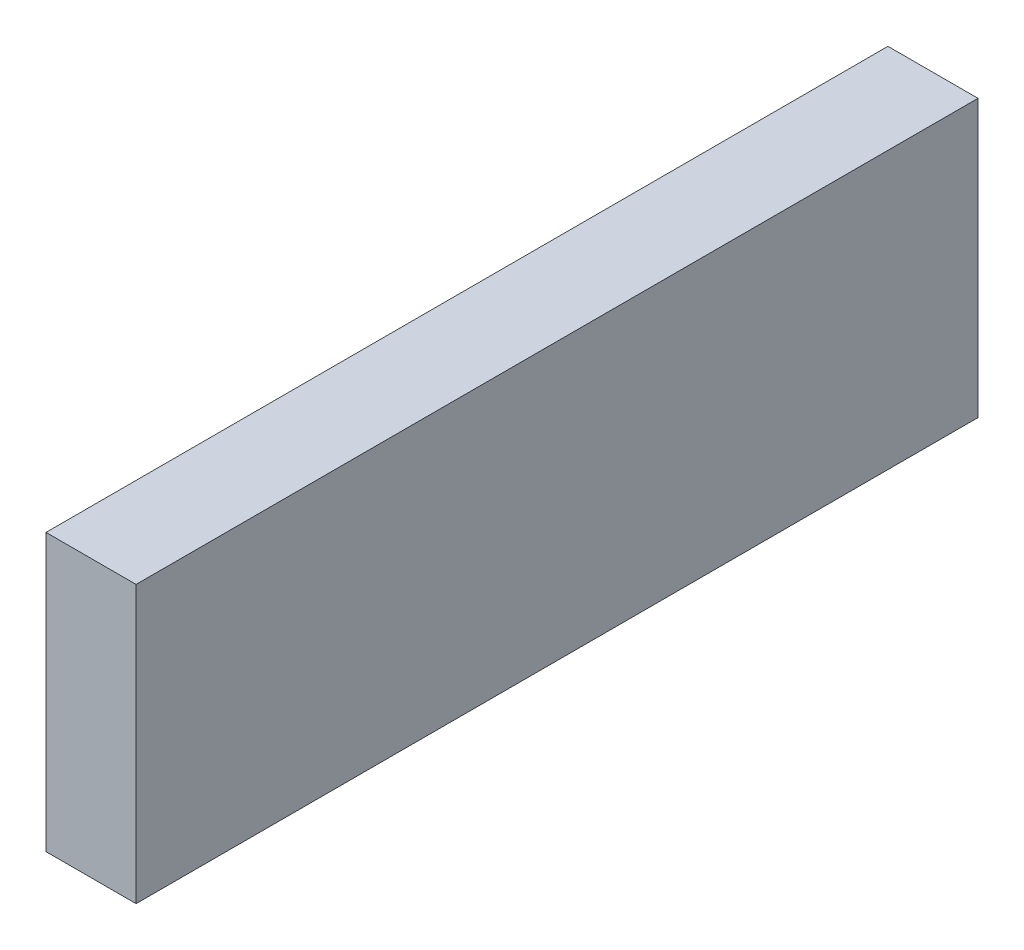
ISO-10303-21;
HEADER;
FILE_DESCRIPTION(('STEP AP214'),'2;1');
FILE_NAME('part.step','',(''),(''),'','','');
FILE_SCHEMA(('AUTOMOTIVE_DESIGN { 1 0 10303 214 1 1 1 1 }'));
ENDSEC;
DATA;
#1=APPLICATION_CONTEXT('core data for automotive mechanical design processes');
#2=APPLICATION_PROTOCOL_DEFINITION('international standard','automotive_design',2000,#1);
#3=PRODUCT_CONTEXT('',#1,'mechanical');
#4=PRODUCT('Part','Part','',(#3));
#5=PRODUCT_RELATED_PRODUCT_CATEGORY('part','',(#4));
#6=PRODUCT_DEFINITION_FORMATION('','',#4);
#7=PRODUCT_DEFINITION_CONTEXT('part definition',#1,'design');
#8=PRODUCT_DEFINITION('design','',#6,#7);
#9=PRODUCT_DEFINITION_SHAPE('','',#8);
#10=(LENGTH_UNIT() NAMED_UNIT(*) SI_UNIT(.MILLI.,.METRE.));
#11=(NAMED_UNIT(*) PLANE_ANGLE_UNIT() SI_UNIT($,.RADIAN.));
#12=(NAMED_UNIT(*) SI_UNIT($,.STERADIAN.) SOLID_ANGLE_UNIT());
#13=UNCERTAINTY_MEASURE_WITH_UNIT(LENGTH_MEASURE(1.E-05),#10,'distance_accuracy_value','');
#14=(GEOMETRIC_REPRESENTATION_CONTEXT(3) GLOBAL_UNCERTAINTY_ASSIGNED_CONTEXT((#13)) GLOBAL_UNIT_ASSIGNED_CONTEXT((#10,
#11,#12)) REPRESENTATION_CONTEXT('',''));
#15=CARTESIAN_POINT('',(0.,0.,0.));
#16=DIRECTION('',(0.,0.,1.));
#17=DIRECTION('',(1.,0.,0.));
#18=AXIS2_PLACEMENT_3D('',#15,#16,#17);
#19=CARTESIAN_POINT('',(0.37449252,-1.14949224,0.));
#20=DIRECTION('',(-1.,0.,0.));
#21=DIRECTION('',(0.,0.,1.));
#22=AXIS2_PLACEMENT_3D('',#19,#20,#21);
#23=PLANE('',#22);
#24=DIRECTION('',(0.,0.,-1.));
#25=VECTOR('',#24,1.);
#26=CARTESIAN_POINT('',(0.37449252,1.14949224,0.));
#27=LINE('',#26,#25);
#28=CARTESIAN_POINT('',(0.37449252,1.14949224,0.));
#29=VERTEX_POINT('',#28);
#30=CARTESIAN_POINT('',(0.37449252,1.14949224,7.));
#31=VERTEX_POINT('',#30);
#32=EDGE_CURVE('E20',#29,#31,#27,.F.);
#33=ORIENTED_EDGE('',*,*,#32,.T.);
#34=DIRECTION('',(0.,1.,0.));
#35=VECTOR('',#34,1.);
#36=CARTESIAN_POINT('',(0.37449252,1.14949224,7.));
#37=LINE('',#36,#35);
#38=CARTESIAN_POINT('',(0.37449252,-1.14949224,7.));
#39=VERTEX_POINT('',#38);
#40=EDGE_CURVE('E55',#31,#39,#37,.F.);
#41=ORIENTED_EDGE('',*,*,#40,.T.);
#42=DIRECTION('',(0.,0.,1.));
#43=VECTOR('',#42,1.);
#44=CARTESIAN_POINT('',(0.37449252,-1.14949224,0.));
#45=LINE('',#44,#43);
#46=CARTESIAN_POINT('',(0.37449252,-1.14949224,0.));
#47=VERTEX_POINT('',#46);
#48=EDGE_CURVE('E76',#39,#47,#45,.F.);
#49=ORIENTED_EDGE('',*,*,#48,.T.);
#50=DIRECTION('',(0.,1.,0.));
#51=VECTOR('',#50,1.);
#52=CARTESIAN_POINT('',(0.37449252,1.14949224,0.));
#53=LINE('',#52,#51);
#54=EDGE_CURVE('E58',#29,#47,#53,.F.);
#55=ORIENTED_EDGE('',*,*,#54,.F.);
#56=EDGE_LOOP('',(#33,#41,#49,#55));
#57=FACE_BOUND('',#56,.T.);
#58=ADVANCED_FACE('F17',(#57),#23,.F.);
#59=CARTESIAN_POINT('',(0.37449252,1.14949224,0.));
#60=DIRECTION('',(0.,-1.,0.));
#61=DIRECTION('',(0.,0.,-1.));
#62=AXIS2_PLACEMENT_3D('',#59,#60,#61);
#63=PLANE('',#62);
#64=DIRECTION('',(0.,0.,-1.));
#65=VECTOR('',#64,1.);
#66=CARTESIAN_POINT('',(-0.37449252,1.14949224,0.));
#67=LINE('',#66,#65);
#68=CARTESIAN_POINT('',(-0.37449252,1.14949224,0.));
#69=VERTEX_POINT('',#68);
#70=CARTESIAN_POINT('',(-0.37449252,1.14949224,7.));
#71=VERTEX_POINT('',#70);
#72=EDGE_CURVE('E73',#69,#71,#67,.F.);
#73=ORIENTED_EDGE('',*,*,#72,.T.);
#74=DIRECTION('',(-1.,0.,0.));
#75=VECTOR('',#74,1.);
#76=CARTESIAN_POINT('',(-0.37449252,1.14949224,7.));
#77=LINE('',#76,#75);
#78=EDGE_CURVE('E63',#71,#31,#77,.F.);
#79=ORIENTED_EDGE('',*,*,#78,.T.);
#80=ORIENTED_EDGE('',*,*,#32,.F.);
#81=DIRECTION('',(-1.,0.,0.));
#82=VECTOR('',#81,1.);
#83=CARTESIAN_POINT('',(-0.37449252,1.14949224,0.));
#84=LINE('',#83,#82);
#85=EDGE_CURVE('E78',#69,#29,#84,.F.);
#86=ORIENTED_EDGE('',*,*,#85,.F.);
#87=EDGE_LOOP('',(#73,#79,#80,#86));
#88=FACE_BOUND('',#87,.T.);
#89=ADVANCED_FACE('F72',(#88),#63,.F.);
#90=CARTESIAN_POINT('',(-0.37449252,1.14949224,7.));
#91=DIRECTION('',(0.,0.,-1.));
#92=DIRECTION('',(-1.,0.,0.));
#93=AXIS2_PLACEMENT_3D('',#90,#91,#92);
#94=PLANE('',#93);
#95=DIRECTION('',(1.,0.,0.));
#96=VECTOR('',#95,1.);
#97=CARTESIAN_POINT('',(-0.37449252,-1.14949224,7.));
#98=LINE('',#97,#96);
#99=CARTESIAN_POINT('',(-0.37449252,-1.14949224,7.));
#100=VERTEX_POINT('',#99);
#101=EDGE_CURVE('E69',#100,#39,#98,.T.);
#102=ORIENTED_EDGE('',*,*,#101,.T.);
#103=ORIENTED_EDGE('',*,*,#40,.F.);
#104=ORIENTED_EDGE('',*,*,#78,.F.);
#105=DIRECTION('',(0.,1.,0.));
#106=VECTOR('',#105,1.);
#107=CARTESIAN_POINT('',(-0.37449252,1.14949224,7.));
#108=LINE('',#107,#106);
#109=EDGE_CURVE('E83',#71,#100,#108,.F.);
#110=ORIENTED_EDGE('',*,*,#109,.T.);
#111=EDGE_LOOP('',(#102,#103,#104,#110));
#112=FACE_BOUND('',#111,.T.);
#113=ADVANCED_FACE('F66',(#112),#94,.F.);
#114=CARTESIAN_POINT('',(-0.37449252,-1.14949224,0.));
#115=DIRECTION('',(0.,1.,0.));
#116=DIRECTION('',(0.,0.,1.));
#117=AXIS2_PLACEMENT_3D('',#114,#115,#116);
#118=PLANE('',#117);
#119=ORIENTED_EDGE('',*,*,#48,.F.);
#120=ORIENTED_EDGE('',*,*,#101,.F.);
#121=DIRECTION('',(0.,0.,-1.));
#122=VECTOR('',#121,1.);
#123=CARTESIAN_POINT('',(-0.37449252,-1.14949224,0.));
#124=LINE('',#123,#122);
#125=CARTESIAN_POINT('',(-0.37449252,-1.14949224,0.));
#126=VERTEX_POINT('',#125);
#127=EDGE_CURVE('E26',#100,#126,#124,.T.);
#128=ORIENTED_EDGE('',*,*,#127,.T.);
#129=DIRECTION('',(-1.,0.,0.));
#130=VECTOR('',#129,1.);
#131=CARTESIAN_POINT('',(-0.37449252,-1.14949224,0.));
#132=LINE('',#131,#130);
#133=EDGE_CURVE('E34',#47,#126,#132,.T.);
#134=ORIENTED_EDGE('',*,*,#133,.F.);
#135=EDGE_LOOP('',(#119,#120,#128,#134));
#136=FACE_BOUND('',#135,.T.);
#137=ADVANCED_FACE('F88',(#136),#118,.F.);
#138=CARTESIAN_POINT('',(-0.37449252,1.14949224,0.));
#139=DIRECTION('',(0.,0.,-1.));
#140=DIRECTION('',(-1.,0.,0.));
#141=AXIS2_PLACEMENT_3D('',#138,#139,#140);
#142=PLANE('',#141);
#143=ORIENTED_EDGE('',*,*,#133,.T.);
#144=DIRECTION('',(0.,1.,0.));
#145=VECTOR('',#144,1.);
#146=CARTESIAN_POINT('',(-0.37449252,1.14949224,0.));
#147=LINE('',#146,#145);
#148=EDGE_CURVE('E11',#126,#69,#147,.T.);
#149=ORIENTED_EDGE('',*,*,#148,.T.);
#150=ORIENTED_EDGE('',*,*,#85,.T.);
#151=ORIENTED_EDGE('',*,*,#54,.T.);
#152=EDGE_LOOP('',(#143,#149,#150,#151));
#153=FACE_BOUND('',#152,.T.);
#154=ADVANCED_FACE('F91',(#153),#142,.T.);
#155=CARTESIAN_POINT('',(-0.37449252,1.14949224,0.));
#156=DIRECTION('',(1.,0.,0.));
#157=DIRECTION('',(0.,0.,-1.));
#158=AXIS2_PLACEMENT_3D('',#155,#156,#157);
#159=PLANE('',#158);
#160=ORIENTED_EDGE('',*,*,#127,.F.);
#161=ORIENTED_EDGE('',*,*,#109,.F.);
#162=ORIENTED_EDGE('',*,*,#72,.F.);
#163=ORIENTED_EDGE('',*,*,#148,.F.);
#164=EDGE_LOOP('',(#160,#161,#162,#163));
#165=FACE_BOUND('',#164,.T.);
#166=ADVANCED_FACE('F90',(#165),#159,.F.);
#167=CLOSED_SHELL('',(#58,#89,#113,#137,#154,#166));
#168=MANIFOLD_SOLID_BREP('B1',#167);
#169=ADVANCED_BREP_SHAPE_REPRESENTATION('',(#18,#168),#14);
#170=SHAPE_DEFINITION_REPRESENTATION(#9,#169);
ENDSEC;
END-ISO-10303-21;
